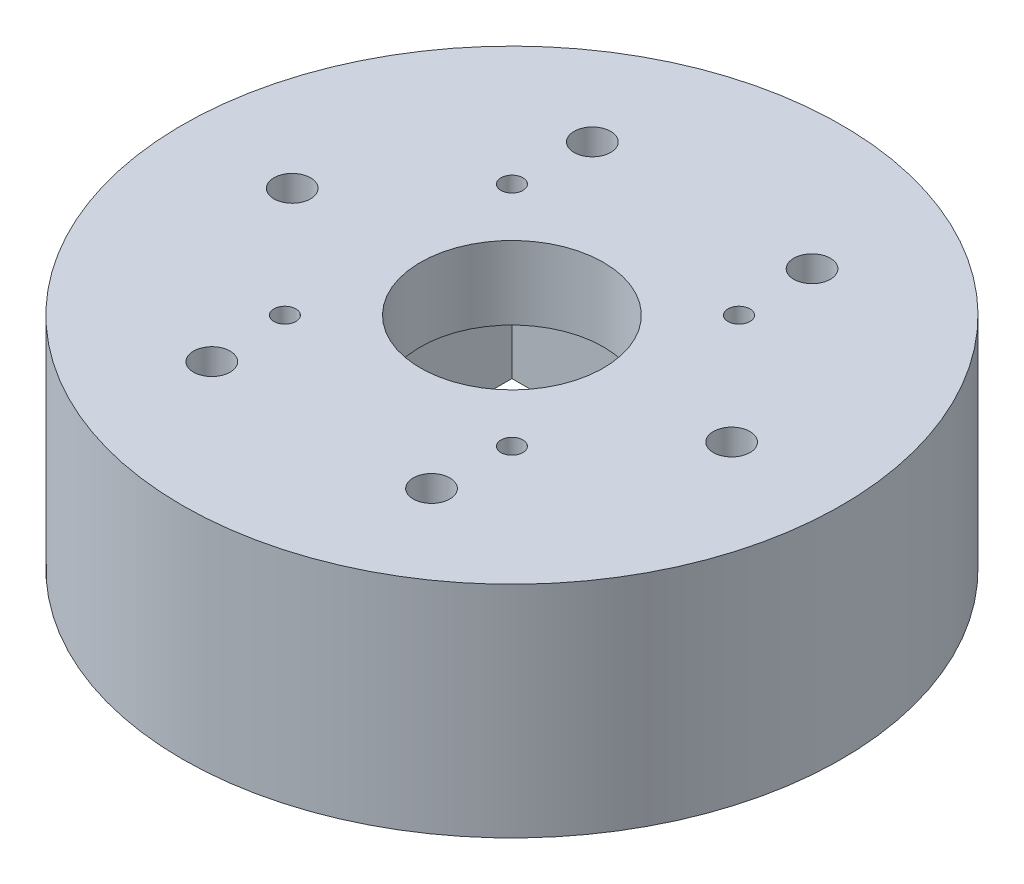
ISO-10303-21;
HEADER;
FILE_DESCRIPTION(('STEP AP214'),'2;1');
FILE_NAME('part.step','',(''),(''),'','','');
FILE_SCHEMA(('AUTOMOTIVE_DESIGN { 1 0 10303 214 1 1 1 1 }'));
ENDSEC;
DATA;
#1=APPLICATION_CONTEXT('core data for automotive mechanical design processes');
#2=APPLICATION_PROTOCOL_DEFINITION('international standard','automotive_design',2000,#1);
#3=PRODUCT_CONTEXT('',#1,'mechanical');
#4=PRODUCT('Part','Part','',(#3));
#5=PRODUCT_RELATED_PRODUCT_CATEGORY('part','',(#4));
#6=PRODUCT_DEFINITION_FORMATION('','',#4);
#7=PRODUCT_DEFINITION_CONTEXT('part definition',#1,'design');
#8=PRODUCT_DEFINITION('design','',#6,#7);
#9=PRODUCT_DEFINITION_SHAPE('','',#8);
#10=(LENGTH_UNIT() NAMED_UNIT(*) SI_UNIT(.MILLI.,.METRE.));
#11=(NAMED_UNIT(*) PLANE_ANGLE_UNIT() SI_UNIT($,.RADIAN.));
#12=(NAMED_UNIT(*) SI_UNIT($,.STERADIAN.) SOLID_ANGLE_UNIT());
#13=UNCERTAINTY_MEASURE_WITH_UNIT(LENGTH_MEASURE(1.E-05),#10,'distance_accuracy_value','');
#14=(GEOMETRIC_REPRESENTATION_CONTEXT(3) GLOBAL_UNCERTAINTY_ASSIGNED_CONTEXT((#13)) GLOBAL_UNIT_ASSIGNED_CONTEXT((#10,
#11,#12)) REPRESENTATION_CONTEXT('',''));
#15=CARTESIAN_POINT('',(0.,0.,0.));
#16=DIRECTION('',(0.,0.,1.));
#17=DIRECTION('',(1.,0.,0.));
#18=AXIS2_PLACEMENT_3D('',#15,#16,#17);
#19=CARTESIAN_POINT('',(0.,30.,0.));
#20=DIRECTION('',(0.,-1.,0.));
#21=DIRECTION('',(0.,0.,-1.));
#22=AXIS2_PLACEMENT_3D('',#19,#20,#21);
#23=CYLINDRICAL_SURFACE('',#22,45.);
#24=CARTESIAN_POINT('',(0.,30.,0.));
#25=DIRECTION('',(0.,1.,0.));
#26=DIRECTION('',(0.,0.,1.));
#27=AXIS2_PLACEMENT_3D('',#24,#25,#26);
#28=CIRCLE('',#27,45.);
#29=CARTESIAN_POINT('',(0.,30.,45.));
#30=VERTEX_POINT('',#29);
#31=EDGE_CURVE('E11',#30,#30,#28,.T.);
#32=ORIENTED_EDGE('',*,*,#31,.F.);
#33=EDGE_LOOP('',(#32));
#34=FACE_BOUND('',#33,.T.);
#35=CARTESIAN_POINT('',(0.,0.,0.));
#36=DIRECTION('',(0.,1.,0.));
#37=DIRECTION('',(0.,0.,1.));
#38=AXIS2_PLACEMENT_3D('',#35,#36,#37);
#39=CIRCLE('',#38,45.);
#40=CARTESIAN_POINT('',(0.,0.,45.));
#41=VERTEX_POINT('',#40);
#42=EDGE_CURVE('E42',#41,#41,#39,.T.);
#43=ORIENTED_EDGE('',*,*,#42,.T.);
#44=EDGE_LOOP('',(#43));
#45=FACE_BOUND('',#44,.T.);
#46=ADVANCED_FACE('F39',(#34,#45),#23,.T.);
#47=CARTESIAN_POINT('',(0.,30.,0.));
#48=DIRECTION('',(0.,1.,0.));
#49=DIRECTION('',(0.,0.,1.));
#50=AXIS2_PLACEMENT_3D('',#47,#48,#49);
#51=PLANE('',#50);
#52=CARTESIAN_POINT('',(-15.4999999999997,30.,-15.5));
#53=DIRECTION('',(0.,-1.,0.));
#54=DIRECTION('',(0.,0.,-1.));
#55=AXIS2_PLACEMENT_3D('',#52,#53,#54);
#56=CIRCLE('',#55,1.5);
#57=CARTESIAN_POINT('',(-15.4999999999997,30.,-17.));
#58=VERTEX_POINT('',#57);
#59=EDGE_CURVE('E324',#58,#58,#56,.T.);
#60=ORIENTED_EDGE('',*,*,#59,.T.);
#61=EDGE_LOOP('',(#60));
#62=FACE_BOUND('',#61,.T.);
#63=CARTESIAN_POINT('',(15.5000000000003,30.,-15.5));
#64=DIRECTION('',(0.,-1.,0.));
#65=DIRECTION('',(0.,0.,-1.));
#66=AXIS2_PLACEMENT_3D('',#63,#64,#65);
#67=CIRCLE('',#66,1.5);
#68=CARTESIAN_POINT('',(15.5000000000003,30.,-17.));
#69=VERTEX_POINT('',#68);
#70=EDGE_CURVE('E316',#69,#69,#67,.T.);
#71=ORIENTED_EDGE('',*,*,#70,.T.);
#72=EDGE_LOOP('',(#71));
#73=FACE_BOUND('',#72,.T.);
#74=CARTESIAN_POINT('',(0.,30.,0.));
#75=DIRECTION('',(0.,-1.,0.));
#76=DIRECTION('',(0.,0.,-1.));
#77=AXIS2_PLACEMENT_3D('',#74,#75,#76);
#78=CIRCLE('',#77,12.5);
#79=CARTESIAN_POINT('',(0.,30.,-12.5));
#80=VERTEX_POINT('',#79);
#81=EDGE_CURVE('E303',#80,#80,#78,.T.);
#82=ORIENTED_EDGE('',*,*,#81,.T.);
#83=EDGE_LOOP('',(#82));
#84=FACE_BOUND('',#83,.T.);
#85=CARTESIAN_POINT('',(15.5,30.,15.5));
#86=DIRECTION('',(0.,-1.,0.));
#87=DIRECTION('',(0.,0.,-1.));
#88=AXIS2_PLACEMENT_3D('',#85,#86,#87);
#89=CIRCLE('',#88,1.5);
#90=CARTESIAN_POINT('',(15.5,30.,14.));
#91=VERTEX_POINT('',#90);
#92=EDGE_CURVE('E297',#91,#91,#89,.T.);
#93=ORIENTED_EDGE('',*,*,#92,.T.);
#94=EDGE_LOOP('',(#93));
#95=FACE_BOUND('',#94,.T.);
#96=CARTESIAN_POINT('',(-15.5,30.,15.5));
#97=DIRECTION('',(0.,-1.,0.));
#98=DIRECTION('',(0.,0.,-1.));
#99=AXIS2_PLACEMENT_3D('',#96,#97,#98);
#100=CIRCLE('',#99,1.5);
#101=CARTESIAN_POINT('',(-15.5,30.,14.));
#102=VERTEX_POINT('',#101);
#103=EDGE_CURVE('E117',#102,#102,#100,.T.);
#104=ORIENTED_EDGE('',*,*,#103,.T.);
#105=EDGE_LOOP('',(#104));
#106=FACE_BOUND('',#105,.T.);
#107=CARTESIAN_POINT('',(30.,30.,0.));
#108=DIRECTION('',(0.,-1.,0.));
#109=DIRECTION('',(0.,0.,-1.));
#110=AXIS2_PLACEMENT_3D('',#107,#108,#109);
#111=CIRCLE('',#110,2.5);
#112=CARTESIAN_POINT('',(30.,30.,-2.5));
#113=VERTEX_POINT('',#112);
#114=EDGE_CURVE('E132',#113,#113,#111,.T.);
#115=ORIENTED_EDGE('',*,*,#114,.T.);
#116=EDGE_LOOP('',(#115));
#117=FACE_BOUND('',#116,.T.);
#118=CARTESIAN_POINT('',(15.,30.,25.9807621135332));
#119=DIRECTION('',(0.,-1.,0.));
#120=DIRECTION('',(0.,0.,-1.));
#121=AXIS2_PLACEMENT_3D('',#118,#119,#120);
#122=CIRCLE('',#121,2.5);
#123=CARTESIAN_POINT('',(15.,30.,23.4807621135332));
#124=VERTEX_POINT('',#123);
#125=EDGE_CURVE('E142',#124,#124,#122,.T.);
#126=ORIENTED_EDGE('',*,*,#125,.T.);
#127=EDGE_LOOP('',(#126));
#128=FACE_BOUND('',#127,.T.);
#129=CARTESIAN_POINT('',(-15.,30.,25.9807621135332));
#130=DIRECTION('',(0.,-1.,0.));
#131=DIRECTION('',(0.,0.,-1.));
#132=AXIS2_PLACEMENT_3D('',#129,#130,#131);
#133=CIRCLE('',#132,2.5);
#134=CARTESIAN_POINT('',(-15.,30.,23.4807621135331));
#135=VERTEX_POINT('',#134);
#136=EDGE_CURVE('E173',#135,#135,#133,.T.);
#137=ORIENTED_EDGE('',*,*,#136,.T.);
#138=EDGE_LOOP('',(#137));
#139=FACE_BOUND('',#138,.T.);
#140=CARTESIAN_POINT('',(-30.,30.,0.));
#141=DIRECTION('',(0.,-1.,0.));
#142=DIRECTION('',(0.,0.,-1.));
#143=AXIS2_PLACEMENT_3D('',#140,#141,#142);
#144=CIRCLE('',#143,2.5);
#145=CARTESIAN_POINT('',(-30.,30.,-2.50000000000001));
#146=VERTEX_POINT('',#145);
#147=EDGE_CURVE('E165',#146,#146,#144,.T.);
#148=ORIENTED_EDGE('',*,*,#147,.T.);
#149=EDGE_LOOP('',(#148));
#150=FACE_BOUND('',#149,.T.);
#151=CARTESIAN_POINT('',(-15.,30.,-25.9807621135332));
#152=DIRECTION('',(0.,-1.,0.));
#153=DIRECTION('',(0.,0.,-1.));
#154=AXIS2_PLACEMENT_3D('',#151,#152,#153);
#155=CIRCLE('',#154,2.50000000000001);
#156=CARTESIAN_POINT('',(-15.,30.,-28.4807621135332));
#157=VERTEX_POINT('',#156);
#158=EDGE_CURVE('E157',#157,#157,#155,.T.);
#159=ORIENTED_EDGE('',*,*,#158,.T.);
#160=EDGE_LOOP('',(#159));
#161=FACE_BOUND('',#160,.T.);
#162=CARTESIAN_POINT('',(15.,30.,-25.9807621135332));
#163=DIRECTION('',(0.,-1.,0.));
#164=DIRECTION('',(0.,0.,-1.));
#165=AXIS2_PLACEMENT_3D('',#162,#163,#164);
#166=CIRCLE('',#165,2.5);
#167=CARTESIAN_POINT('',(15.,30.,-28.4807621135332));
#168=VERTEX_POINT('',#167);
#169=EDGE_CURVE('E141',#168,#168,#166,.T.);
#170=ORIENTED_EDGE('',*,*,#169,.T.);
#171=EDGE_LOOP('',(#170));
#172=FACE_BOUND('',#171,.T.);
#173=ORIENTED_EDGE('',*,*,#31,.T.);
#174=EDGE_LOOP('',(#173));
#175=FACE_BOUND('',#174,.T.);
#176=ADVANCED_FACE('F201',(#62,#73,#84,#95,#106,#117,#128,#139,#150,#161,#172,#175),#51,.T.);
#177=CARTESIAN_POINT('',(0.,0.,0.));
#178=DIRECTION('',(0.,1.,0.));
#179=DIRECTION('',(0.,0.,1.));
#180=AXIS2_PLACEMENT_3D('',#177,#178,#179);
#181=PLANE('',#180);
#182=DIRECTION('',(-1.,0.,0.));
#183=VECTOR('',#182,1.);
#184=CARTESIAN_POINT('',(-22.5,0.,22.5));
#185=LINE('',#184,#183);
#186=CARTESIAN_POINT('',(22.5,0.,22.5));
#187=VERTEX_POINT('',#186);
#188=CARTESIAN_POINT('',(-22.5,0.,22.5));
#189=VERTEX_POINT('',#188);
#190=EDGE_CURVE('E89',#187,#189,#185,.T.);
#191=ORIENTED_EDGE('',*,*,#190,.F.);
#192=DIRECTION('',(0.,0.,1.));
#193=VECTOR('',#192,1.);
#194=CARTESIAN_POINT('',(22.5,0.,22.5));
#195=LINE('',#194,#193);
#196=CARTESIAN_POINT('',(22.5,0.,-22.5));
#197=VERTEX_POINT('',#196);
#198=EDGE_CURVE('E54',#197,#187,#195,.T.);
#199=ORIENTED_EDGE('',*,*,#198,.F.);
#200=DIRECTION('',(1.,0.,0.));
#201=VECTOR('',#200,1.);
#202=CARTESIAN_POINT('',(-22.5,0.,-22.5));
#203=LINE('',#202,#201);
#204=CARTESIAN_POINT('',(-22.5,0.,-22.5));
#205=VERTEX_POINT('',#204);
#206=EDGE_CURVE('E109',#205,#197,#203,.T.);
#207=ORIENTED_EDGE('',*,*,#206,.F.);
#208=DIRECTION('',(0.,0.,-1.));
#209=VECTOR('',#208,1.);
#210=CARTESIAN_POINT('',(-22.5,0.,22.5));
#211=LINE('',#210,#209);
#212=EDGE_CURVE('E120',#189,#205,#211,.T.);
#213=ORIENTED_EDGE('',*,*,#212,.F.);
#214=EDGE_LOOP('',(#191,#199,#207,#213));
#215=FACE_BOUND('',#214,.T.);
#216=CARTESIAN_POINT('',(30.,0.,0.));
#217=DIRECTION('',(0.,-1.,0.));
#218=DIRECTION('',(0.,0.,-1.));
#219=AXIS2_PLACEMENT_3D('',#216,#217,#218);
#220=CIRCLE('',#219,2.5);
#221=CARTESIAN_POINT('',(30.,0.,-2.5));
#222=VERTEX_POINT('',#221);
#223=EDGE_CURVE('E137',#222,#222,#220,.T.);
#224=ORIENTED_EDGE('',*,*,#223,.F.);
#225=EDGE_LOOP('',(#224));
#226=FACE_BOUND('',#225,.T.);
#227=CARTESIAN_POINT('',(15.,0.,25.9807621135332));
#228=DIRECTION('',(0.,-1.,0.));
#229=DIRECTION('',(0.,0.,-1.));
#230=AXIS2_PLACEMENT_3D('',#227,#228,#229);
#231=CIRCLE('',#230,2.5);
#232=CARTESIAN_POINT('',(15.,0.,23.4807621135332));
#233=VERTEX_POINT('',#232);
#234=EDGE_CURVE('E127',#233,#233,#231,.T.);
#235=ORIENTED_EDGE('',*,*,#234,.F.);
#236=EDGE_LOOP('',(#235));
#237=FACE_BOUND('',#236,.T.);
#238=CARTESIAN_POINT('',(-15.,0.,25.9807621135332));
#239=DIRECTION('',(0.,-1.,0.));
#240=DIRECTION('',(0.,0.,-1.));
#241=AXIS2_PLACEMENT_3D('',#238,#239,#240);
#242=CIRCLE('',#241,2.5);
#243=CARTESIAN_POINT('',(-15.,0.,23.4807621135331));
#244=VERTEX_POINT('',#243);
#245=EDGE_CURVE('E146',#244,#244,#242,.T.);
#246=ORIENTED_EDGE('',*,*,#245,.F.);
#247=EDGE_LOOP('',(#246));
#248=FACE_BOUND('',#247,.T.);
#249=CARTESIAN_POINT('',(-30.,0.,0.));
#250=DIRECTION('',(0.,-1.,0.));
#251=DIRECTION('',(0.,0.,-1.));
#252=AXIS2_PLACEMENT_3D('',#249,#250,#251);
#253=CIRCLE('',#252,2.5);
#254=CARTESIAN_POINT('',(-30.,0.,-2.50000000000001));
#255=VERTEX_POINT('',#254);
#256=EDGE_CURVE('E169',#255,#255,#253,.T.);
#257=ORIENTED_EDGE('',*,*,#256,.F.);
#258=EDGE_LOOP('',(#257));
#259=FACE_BOUND('',#258,.T.);
#260=CARTESIAN_POINT('',(-15.,0.,-25.9807621135332));
#261=DIRECTION('',(0.,-1.,0.));
#262=DIRECTION('',(0.,0.,-1.));
#263=AXIS2_PLACEMENT_3D('',#260,#261,#262);
#264=CIRCLE('',#263,2.50000000000001);
#265=CARTESIAN_POINT('',(-15.,0.,-28.4807621135332));
#266=VERTEX_POINT('',#265);
#267=EDGE_CURVE('E161',#266,#266,#264,.T.);
#268=ORIENTED_EDGE('',*,*,#267,.F.);
#269=EDGE_LOOP('',(#268));
#270=FACE_BOUND('',#269,.T.);
#271=CARTESIAN_POINT('',(15.,0.,-25.9807621135332));
#272=DIRECTION('',(0.,-1.,0.));
#273=DIRECTION('',(0.,0.,-1.));
#274=AXIS2_PLACEMENT_3D('',#271,#272,#273);
#275=CIRCLE('',#274,2.5);
#276=CARTESIAN_POINT('',(15.,0.,-28.4807621135332));
#277=VERTEX_POINT('',#276);
#278=EDGE_CURVE('E153',#277,#277,#275,.T.);
#279=ORIENTED_EDGE('',*,*,#278,.F.);
#280=EDGE_LOOP('',(#279));
#281=FACE_BOUND('',#280,.T.);
#282=CARTESIAN_POINT('',(0.,0.,32.5));
#283=DIRECTION('',(0.,-1.,0.));
#284=DIRECTION('',(0.,0.,-1.));
#285=AXIS2_PLACEMENT_3D('',#282,#283,#284);
#286=CIRCLE('',#285,4.);
#287=CARTESIAN_POINT('',(0.,0.,28.5));
#288=VERTEX_POINT('',#287);
#289=EDGE_CURVE('E184',#288,#288,#286,.T.);
#290=ORIENTED_EDGE('',*,*,#289,.F.);
#291=EDGE_LOOP('',(#290));
#292=FACE_BOUND('',#291,.T.);
#293=CARTESIAN_POINT('',(0.,0.,-32.5));
#294=DIRECTION('',(0.,-1.,0.));
#295=DIRECTION('',(0.,0.,-1.));
#296=AXIS2_PLACEMENT_3D('',#293,#294,#295);
#297=CIRCLE('',#296,4.);
#298=CARTESIAN_POINT('',(0.,0.,-36.5));
#299=VERTEX_POINT('',#298);
#300=EDGE_CURVE('E136',#299,#299,#297,.T.);
#301=ORIENTED_EDGE('',*,*,#300,.F.);
#302=EDGE_LOOP('',(#301));
#303=FACE_BOUND('',#302,.T.);
#304=ORIENTED_EDGE('',*,*,#42,.F.);
#305=EDGE_LOOP('',(#304));
#306=FACE_BOUND('',#305,.T.);
#307=ADVANCED_FACE('F198',(#215,#226,#237,#248,#259,#270,#281,#292,#303,#306),#181,.F.);
#308=CARTESIAN_POINT('',(0.,20.,-32.5));
#309=DIRECTION('',(0.,-1.,0.));
#310=DIRECTION('',(0.,0.,-1.));
#311=AXIS2_PLACEMENT_3D('',#308,#309,#310);
#312=CYLINDRICAL_SURFACE('',#311,4.);
#313=CARTESIAN_POINT('',(0.,20.,-32.5));
#314=DIRECTION('',(0.,-1.,0.));
#315=DIRECTION('',(0.,0.,-1.));
#316=AXIS2_PLACEMENT_3D('',#313,#314,#315);
#317=CIRCLE('',#316,4.);
#318=CARTESIAN_POINT('',(0.,20.,-36.5));
#319=VERTEX_POINT('',#318);
#320=EDGE_CURVE('E188',#319,#319,#317,.T.);
#321=ORIENTED_EDGE('',*,*,#320,.F.);
#322=EDGE_LOOP('',(#321));
#323=FACE_BOUND('',#322,.T.);
#324=ORIENTED_EDGE('',*,*,#300,.T.);
#325=EDGE_LOOP('',(#324));
#326=FACE_BOUND('',#325,.T.);
#327=ADVANCED_FACE('F196',(#323,#326),#312,.F.);
#328=CARTESIAN_POINT('',(0.,20.,-32.5));
#329=DIRECTION('',(0.,-1.,0.));
#330=DIRECTION('',(0.,0.,-1.));
#331=AXIS2_PLACEMENT_3D('',#328,#329,#330);
#332=PLANE('',#331);
#333=ORIENTED_EDGE('',*,*,#320,.T.);
#334=EDGE_LOOP('',(#333));
#335=FACE_BOUND('',#334,.T.);
#336=ADVANCED_FACE('F223',(#335),#332,.T.);
#337=CARTESIAN_POINT('',(0.,20.,32.5));
#338=DIRECTION('',(0.,-1.,0.));
#339=DIRECTION('',(0.,0.,-1.));
#340=AXIS2_PLACEMENT_3D('',#337,#338,#339);
#341=CYLINDRICAL_SURFACE('',#340,4.);
#342=CARTESIAN_POINT('',(0.,20.,32.5));
#343=DIRECTION('',(0.,-1.,0.));
#344=DIRECTION('',(0.,0.,-1.));
#345=AXIS2_PLACEMENT_3D('',#342,#343,#344);
#346=CIRCLE('',#345,4.);
#347=CARTESIAN_POINT('',(0.,20.,28.5));
#348=VERTEX_POINT('',#347);
#349=EDGE_CURVE('E180',#348,#348,#346,.T.);
#350=ORIENTED_EDGE('',*,*,#349,.F.);
#351=EDGE_LOOP('',(#350));
#352=FACE_BOUND('',#351,.T.);
#353=ORIENTED_EDGE('',*,*,#289,.T.);
#354=EDGE_LOOP('',(#353));
#355=FACE_BOUND('',#354,.T.);
#356=ADVANCED_FACE('F227',(#352,#355),#341,.F.);
#357=CARTESIAN_POINT('',(0.,20.,32.5));
#358=DIRECTION('',(0.,-1.,0.));
#359=DIRECTION('',(0.,0.,-1.));
#360=AXIS2_PLACEMENT_3D('',#357,#358,#359);
#361=PLANE('',#360);
#362=ORIENTED_EDGE('',*,*,#349,.T.);
#363=EDGE_LOOP('',(#362));
#364=FACE_BOUND('',#363,.T.);
#365=ADVANCED_FACE('F231',(#364),#361,.T.);
#366=CARTESIAN_POINT('',(15.,30.,-25.9807621135332));
#367=DIRECTION('',(0.,-1.,0.));
#368=DIRECTION('',(0.,0.,-1.));
#369=AXIS2_PLACEMENT_3D('',#366,#367,#368);
#370=CYLINDRICAL_SURFACE('',#369,2.5);
#371=ORIENTED_EDGE('',*,*,#169,.F.);
#372=EDGE_LOOP('',(#371));
#373=FACE_BOUND('',#372,.T.);
#374=ORIENTED_EDGE('',*,*,#278,.T.);
#375=EDGE_LOOP('',(#374));
#376=FACE_BOUND('',#375,.T.);
#377=ADVANCED_FACE('F235',(#373,#376),#370,.F.);
#378=CARTESIAN_POINT('',(-15.,30.,-25.9807621135332));
#379=DIRECTION('',(0.,-1.,0.));
#380=DIRECTION('',(0.,0.,-1.));
#381=AXIS2_PLACEMENT_3D('',#378,#379,#380);
#382=CYLINDRICAL_SURFACE('',#381,2.50000000000001);
#383=ORIENTED_EDGE('',*,*,#158,.F.);
#384=EDGE_LOOP('',(#383));
#385=FACE_BOUND('',#384,.T.);
#386=ORIENTED_EDGE('',*,*,#267,.T.);
#387=EDGE_LOOP('',(#386));
#388=FACE_BOUND('',#387,.T.);
#389=ADVANCED_FACE('F245',(#385,#388),#382,.F.);
#390=CARTESIAN_POINT('',(-30.,30.,0.));
#391=DIRECTION('',(0.,-1.,0.));
#392=DIRECTION('',(0.,0.,-1.));
#393=AXIS2_PLACEMENT_3D('',#390,#391,#392);
#394=CYLINDRICAL_SURFACE('',#393,2.5);
#395=ORIENTED_EDGE('',*,*,#147,.F.);
#396=EDGE_LOOP('',(#395));
#397=FACE_BOUND('',#396,.T.);
#398=ORIENTED_EDGE('',*,*,#256,.T.);
#399=EDGE_LOOP('',(#398));
#400=FACE_BOUND('',#399,.T.);
#401=ADVANCED_FACE('F241',(#397,#400),#394,.F.);
#402=CARTESIAN_POINT('',(-15.,30.,25.9807621135332));
#403=DIRECTION('',(0.,-1.,0.));
#404=DIRECTION('',(0.,0.,-1.));
#405=AXIS2_PLACEMENT_3D('',#402,#403,#404);
#406=CYLINDRICAL_SURFACE('',#405,2.5);
#407=ORIENTED_EDGE('',*,*,#136,.F.);
#408=EDGE_LOOP('',(#407));
#409=FACE_BOUND('',#408,.T.);
#410=ORIENTED_EDGE('',*,*,#245,.T.);
#411=EDGE_LOOP('',(#410));
#412=FACE_BOUND('',#411,.T.);
#413=ADVANCED_FACE('F237',(#409,#412),#406,.F.);
#414=CARTESIAN_POINT('',(15.,30.,25.9807621135332));
#415=DIRECTION('',(0.,-1.,0.));
#416=DIRECTION('',(0.,0.,-1.));
#417=AXIS2_PLACEMENT_3D('',#414,#415,#416);
#418=CYLINDRICAL_SURFACE('',#417,2.5);
#419=ORIENTED_EDGE('',*,*,#125,.F.);
#420=EDGE_LOOP('',(#419));
#421=FACE_BOUND('',#420,.T.);
#422=ORIENTED_EDGE('',*,*,#234,.T.);
#423=EDGE_LOOP('',(#422));
#424=FACE_BOUND('',#423,.T.);
#425=ADVANCED_FACE('F240',(#421,#424),#418,.F.);
#426=CARTESIAN_POINT('',(30.,30.,0.));
#427=DIRECTION('',(0.,-1.,0.));
#428=DIRECTION('',(0.,0.,-1.));
#429=AXIS2_PLACEMENT_3D('',#426,#427,#428);
#430=CYLINDRICAL_SURFACE('',#429,2.5);
#431=ORIENTED_EDGE('',*,*,#114,.F.);
#432=EDGE_LOOP('',(#431));
#433=FACE_BOUND('',#432,.T.);
#434=ORIENTED_EDGE('',*,*,#223,.T.);
#435=EDGE_LOOP('',(#434));
#436=FACE_BOUND('',#435,.T.);
#437=ADVANCED_FACE('F255',(#433,#436),#430,.F.);
#438=CARTESIAN_POINT('',(22.5,20.,22.5));
#439=DIRECTION('',(1.,0.,0.));
#440=DIRECTION('',(0.,0.,-1.));
#441=AXIS2_PLACEMENT_3D('',#438,#439,#440);
#442=PLANE('',#441);
#443=ORIENTED_EDGE('',*,*,#198,.T.);
#444=DIRECTION('',(0.,-1.,0.));
#445=VECTOR('',#444,1.);
#446=CARTESIAN_POINT('',(22.5,20.,22.5));
#447=LINE('',#446,#445);
#448=CARTESIAN_POINT('',(22.5,20.,22.5));
#449=VERTEX_POINT('',#448);
#450=EDGE_CURVE('E77',#449,#187,#447,.T.);
#451=ORIENTED_EDGE('',*,*,#450,.F.);
#452=DIRECTION('',(0.,0.,1.));
#453=VECTOR('',#452,1.);
#454=CARTESIAN_POINT('',(22.5,20.,22.5));
#455=LINE('',#454,#453);
#456=CARTESIAN_POINT('',(22.5,20.,-22.5));
#457=VERTEX_POINT('',#456);
#458=EDGE_CURVE('E105',#457,#449,#455,.T.);
#459=ORIENTED_EDGE('',*,*,#458,.F.);
#460=DIRECTION('',(0.,-1.,0.));
#461=VECTOR('',#460,1.);
#462=CARTESIAN_POINT('',(22.5,20.,-22.5));
#463=LINE('',#462,#461);
#464=EDGE_CURVE('E62',#457,#197,#463,.T.);
#465=ORIENTED_EDGE('',*,*,#464,.T.);
#466=EDGE_LOOP('',(#443,#451,#459,#465));
#467=FACE_BOUND('',#466,.T.);
#468=ADVANCED_FACE('F259',(#467),#442,.F.);
#469=CARTESIAN_POINT('',(-22.5,20.,-22.5));
#470=DIRECTION('',(0.,0.,-1.));
#471=DIRECTION('',(-1.,0.,0.));
#472=AXIS2_PLACEMENT_3D('',#469,#470,#471);
#473=PLANE('',#472);
#474=ORIENTED_EDGE('',*,*,#206,.T.);
#475=ORIENTED_EDGE('',*,*,#464,.F.);
#476=DIRECTION('',(1.,0.,0.));
#477=VECTOR('',#476,1.);
#478=CARTESIAN_POINT('',(-22.5,20.,-22.5));
#479=LINE('',#478,#477);
#480=CARTESIAN_POINT('',(-22.5,20.,-22.5));
#481=VERTEX_POINT('',#480);
#482=EDGE_CURVE('E102',#481,#457,#479,.T.);
#483=ORIENTED_EDGE('',*,*,#482,.F.);
#484=DIRECTION('',(0.,-1.,0.));
#485=VECTOR('',#484,1.);
#486=CARTESIAN_POINT('',(-22.5,20.,-22.5));
#487=LINE('',#486,#485);
#488=EDGE_CURVE('E94',#481,#205,#487,.T.);
#489=ORIENTED_EDGE('',*,*,#488,.T.);
#490=EDGE_LOOP('',(#474,#475,#483,#489));
#491=FACE_BOUND('',#490,.T.);
#492=ADVANCED_FACE('F263',(#491),#473,.F.);
#493=CARTESIAN_POINT('',(-22.5,20.,22.5));
#494=DIRECTION('',(-1.,0.,0.));
#495=DIRECTION('',(0.,0.,1.));
#496=AXIS2_PLACEMENT_3D('',#493,#494,#495);
#497=PLANE('',#496);
#498=ORIENTED_EDGE('',*,*,#212,.T.);
#499=ORIENTED_EDGE('',*,*,#488,.F.);
#500=DIRECTION('',(0.,0.,-1.));
#501=VECTOR('',#500,1.);
#502=CARTESIAN_POINT('',(-22.5,20.,22.5));
#503=LINE('',#502,#501);
#504=CARTESIAN_POINT('',(-22.5,20.,22.5));
#505=VERTEX_POINT('',#504);
#506=EDGE_CURVE('E97',#505,#481,#503,.T.);
#507=ORIENTED_EDGE('',*,*,#506,.F.);
#508=DIRECTION('',(0.,-1.,0.));
#509=VECTOR('',#508,1.);
#510=CARTESIAN_POINT('',(-22.5,20.,22.5));
#511=LINE('',#510,#509);
#512=EDGE_CURVE('E82',#505,#189,#511,.T.);
#513=ORIENTED_EDGE('',*,*,#512,.T.);
#514=EDGE_LOOP('',(#498,#499,#507,#513));
#515=FACE_BOUND('',#514,.T.);
#516=ADVANCED_FACE('F98',(#515),#497,.F.);
#517=CARTESIAN_POINT('',(-22.5,20.,22.5));
#518=DIRECTION('',(0.,0.,1.));
#519=DIRECTION('',(1.,0.,0.));
#520=AXIS2_PLACEMENT_3D('',#517,#518,#519);
#521=PLANE('',#520);
#522=ORIENTED_EDGE('',*,*,#190,.T.);
#523=ORIENTED_EDGE('',*,*,#512,.F.);
#524=DIRECTION('',(-1.,0.,0.));
#525=VECTOR('',#524,1.);
#526=CARTESIAN_POINT('',(-22.5,20.,22.5));
#527=LINE('',#526,#525);
#528=EDGE_CURVE('E86',#449,#505,#527,.T.);
#529=ORIENTED_EDGE('',*,*,#528,.F.);
#530=ORIENTED_EDGE('',*,*,#450,.T.);
#531=EDGE_LOOP('',(#522,#523,#529,#530));
#532=FACE_BOUND('',#531,.T.);
#533=ADVANCED_FACE('F84',(#532),#521,.F.);
#534=CARTESIAN_POINT('',(0.,20.,0.));
#535=DIRECTION('',(0.,-1.,0.));
#536=DIRECTION('',(0.,0.,-1.));
#537=AXIS2_PLACEMENT_3D('',#534,#535,#536);
#538=PLANE('',#537);
#539=CARTESIAN_POINT('',(0.,20.,0.));
#540=DIRECTION('',(0.,-1.,0.));
#541=DIRECTION('',(0.,0.,-1.));
#542=AXIS2_PLACEMENT_3D('',#539,#540,#541);
#543=CIRCLE('',#542,12.5);
#544=CARTESIAN_POINT('',(0.,20.,-12.5));
#545=VERTEX_POINT('',#544);
#546=EDGE_CURVE('E310',#545,#545,#543,.T.);
#547=ORIENTED_EDGE('',*,*,#546,.F.);
#548=EDGE_LOOP('',(#547));
#549=FACE_BOUND('',#548,.T.);
#550=CARTESIAN_POINT('',(-15.4999999999997,20.,-15.5));
#551=DIRECTION('',(0.,-1.,0.));
#552=DIRECTION('',(0.,0.,-1.));
#553=AXIS2_PLACEMENT_3D('',#550,#551,#552);
#554=CIRCLE('',#553,1.5);
#555=CARTESIAN_POINT('',(-15.4999999999997,20.,-17.));
#556=VERTEX_POINT('',#555);
#557=EDGE_CURVE('E327',#556,#556,#554,.T.);
#558=ORIENTED_EDGE('',*,*,#557,.F.);
#559=EDGE_LOOP('',(#558));
#560=FACE_BOUND('',#559,.T.);
#561=CARTESIAN_POINT('',(15.5000000000003,20.,-15.5));
#562=DIRECTION('',(0.,-1.,0.));
#563=DIRECTION('',(0.,0.,-1.));
#564=AXIS2_PLACEMENT_3D('',#561,#562,#563);
#565=CIRCLE('',#564,1.5);
#566=CARTESIAN_POINT('',(15.5000000000003,20.,-17.));
#567=VERTEX_POINT('',#566);
#568=EDGE_CURVE('E320',#567,#567,#565,.T.);
#569=ORIENTED_EDGE('',*,*,#568,.F.);
#570=EDGE_LOOP('',(#569));
#571=FACE_BOUND('',#570,.T.);
#572=CARTESIAN_POINT('',(15.5,20.,15.5));
#573=DIRECTION('',(0.,-1.,0.));
#574=DIRECTION('',(0.,0.,-1.));
#575=AXIS2_PLACEMENT_3D('',#572,#573,#574);
#576=CIRCLE('',#575,1.5);
#577=CARTESIAN_POINT('',(15.5,20.,14.));
#578=VERTEX_POINT('',#577);
#579=EDGE_CURVE('E300',#578,#578,#576,.T.);
#580=ORIENTED_EDGE('',*,*,#579,.F.);
#581=EDGE_LOOP('',(#580));
#582=FACE_BOUND('',#581,.T.);
#583=CARTESIAN_POINT('',(-15.5,20.,15.5));
#584=DIRECTION('',(0.,-1.,0.));
#585=DIRECTION('',(0.,0.,-1.));
#586=AXIS2_PLACEMENT_3D('',#583,#584,#585);
#587=CIRCLE('',#586,1.5);
#588=CARTESIAN_POINT('',(-15.5,20.,14.));
#589=VERTEX_POINT('',#588);
#590=EDGE_CURVE('E307',#589,#589,#587,.T.);
#591=ORIENTED_EDGE('',*,*,#590,.F.);
#592=EDGE_LOOP('',(#591));
#593=FACE_BOUND('',#592,.T.);
#594=ORIENTED_EDGE('',*,*,#458,.T.);
#595=ORIENTED_EDGE('',*,*,#528,.T.);
#596=ORIENTED_EDGE('',*,*,#506,.T.);
#597=ORIENTED_EDGE('',*,*,#482,.T.);
#598=EDGE_LOOP('',(#594,#595,#596,#597));
#599=FACE_BOUND('',#598,.T.);
#600=ADVANCED_FACE('F104',(#549,#560,#571,#582,#593,#599),#538,.T.);
#601=CARTESIAN_POINT('',(-15.5,30.,15.5));
#602=DIRECTION('',(0.,-1.,0.));
#603=DIRECTION('',(0.,0.,-1.));
#604=AXIS2_PLACEMENT_3D('',#601,#602,#603);
#605=CYLINDRICAL_SURFACE('',#604,1.5);
#606=ORIENTED_EDGE('',*,*,#103,.F.);
#607=EDGE_LOOP('',(#606));
#608=FACE_BOUND('',#607,.T.);
#609=ORIENTED_EDGE('',*,*,#590,.T.);
#610=EDGE_LOOP('',(#609));
#611=FACE_BOUND('',#610,.T.);
#612=ADVANCED_FACE('F272',(#608,#611),#605,.F.);
#613=CARTESIAN_POINT('',(15.5,30.,15.5));
#614=DIRECTION('',(0.,-1.,0.));
#615=DIRECTION('',(0.,0.,-1.));
#616=AXIS2_PLACEMENT_3D('',#613,#614,#615);
#617=CYLINDRICAL_SURFACE('',#616,1.5);
#618=ORIENTED_EDGE('',*,*,#92,.F.);
#619=EDGE_LOOP('',(#618));
#620=FACE_BOUND('',#619,.T.);
#621=ORIENTED_EDGE('',*,*,#579,.T.);
#622=EDGE_LOOP('',(#621));
#623=FACE_BOUND('',#622,.T.);
#624=ADVANCED_FACE('F276',(#620,#623),#617,.F.);
#625=CARTESIAN_POINT('',(15.5000000000003,30.,-15.5));
#626=DIRECTION('',(0.,-1.,0.));
#627=DIRECTION('',(0.,0.,-1.));
#628=AXIS2_PLACEMENT_3D('',#625,#626,#627);
#629=CYLINDRICAL_SURFACE('',#628,1.5);
#630=ORIENTED_EDGE('',*,*,#70,.F.);
#631=EDGE_LOOP('',(#630));
#632=FACE_BOUND('',#631,.T.);
#633=ORIENTED_EDGE('',*,*,#568,.T.);
#634=EDGE_LOOP('',(#633));
#635=FACE_BOUND('',#634,.T.);
#636=ADVANCED_FACE('F282',(#632,#635),#629,.F.);
#637=CARTESIAN_POINT('',(-15.4999999999997,30.,-15.5));
#638=DIRECTION('',(0.,-1.,0.));
#639=DIRECTION('',(0.,0.,-1.));
#640=AXIS2_PLACEMENT_3D('',#637,#638,#639);
#641=CYLINDRICAL_SURFACE('',#640,1.5);
#642=ORIENTED_EDGE('',*,*,#59,.F.);
#643=EDGE_LOOP('',(#642));
#644=FACE_BOUND('',#643,.T.);
#645=ORIENTED_EDGE('',*,*,#557,.T.);
#646=EDGE_LOOP('',(#645));
#647=FACE_BOUND('',#646,.T.);
#648=ADVANCED_FACE('F278',(#644,#647),#641,.F.);
#649=CARTESIAN_POINT('',(0.,30.,0.));
#650=DIRECTION('',(0.,-1.,0.));
#651=DIRECTION('',(0.,0.,-1.));
#652=AXIS2_PLACEMENT_3D('',#649,#650,#651);
#653=CYLINDRICAL_SURFACE('',#652,12.5);
#654=ORIENTED_EDGE('',*,*,#81,.F.);
#655=EDGE_LOOP('',(#654));
#656=FACE_BOUND('',#655,.T.);
#657=ORIENTED_EDGE('',*,*,#546,.T.);
#658=EDGE_LOOP('',(#657));
#659=FACE_BOUND('',#658,.T.);
#660=ADVANCED_FACE('F281',(#656,#659),#653,.F.);
#661=CLOSED_SHELL('',(#46,#176,#307,#327,#336,#356,#365,#377,#389,#401,#413,#425,#437,#468,#492,
#516,#533,#600,#612,#624,#636,#648,#660));
#662=MANIFOLD_SOLID_BREP('B2',#661);
#663=ADVANCED_BREP_SHAPE_REPRESENTATION('',(#18,#662),#14);
#664=SHAPE_DEFINITION_REPRESENTATION(#9,#663);
ENDSEC;
END-ISO-10303-21;
